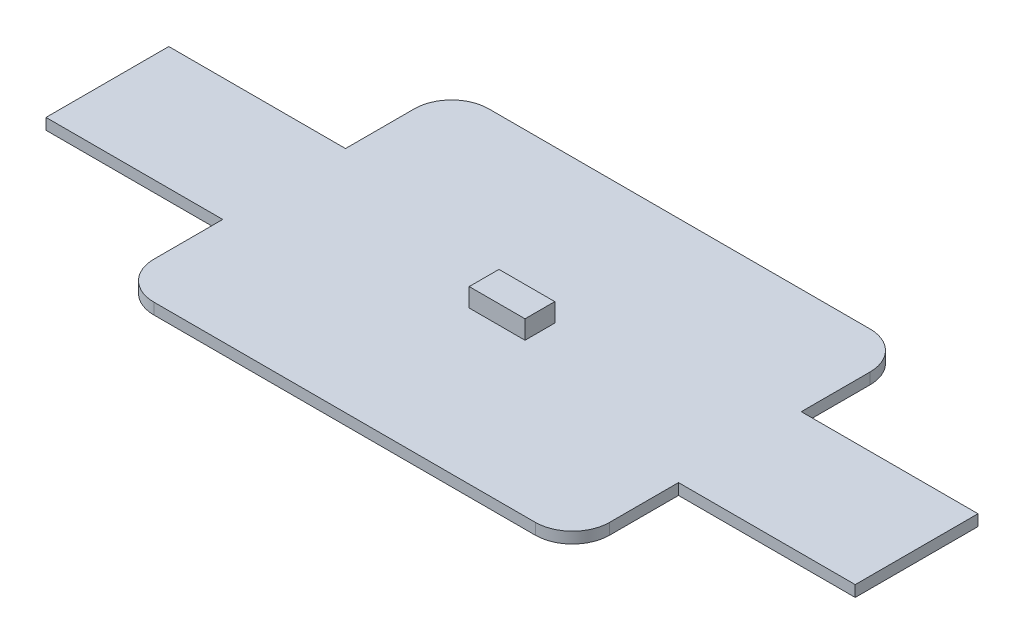
ISO-10303-21;
HEADER;
FILE_DESCRIPTION(('STEP AP214'),'2;1');
FILE_NAME('part.step','',(''),(''),'','','');
FILE_SCHEMA(('AUTOMOTIVE_DESIGN { 1 0 10303 214 1 1 1 1 }'));
ENDSEC;
DATA;
#1=APPLICATION_CONTEXT('core data for automotive mechanical design processes');
#2=APPLICATION_PROTOCOL_DEFINITION('international standard','automotive_design',2000,#1);
#3=PRODUCT_CONTEXT('',#1,'mechanical');
#4=PRODUCT('Part','Part','',(#3));
#5=PRODUCT_RELATED_PRODUCT_CATEGORY('part','',(#4));
#6=PRODUCT_DEFINITION_FORMATION('','',#4);
#7=PRODUCT_DEFINITION_CONTEXT('part definition',#1,'design');
#8=PRODUCT_DEFINITION('design','',#6,#7);
#9=PRODUCT_DEFINITION_SHAPE('','',#8);
#10=(LENGTH_UNIT() NAMED_UNIT(*) SI_UNIT(.MILLI.,.METRE.));
#11=(NAMED_UNIT(*) PLANE_ANGLE_UNIT() SI_UNIT($,.RADIAN.));
#12=(NAMED_UNIT(*) SI_UNIT($,.STERADIAN.) SOLID_ANGLE_UNIT());
#13=UNCERTAINTY_MEASURE_WITH_UNIT(LENGTH_MEASURE(1.E-05),#10,'distance_accuracy_value','');
#14=(GEOMETRIC_REPRESENTATION_CONTEXT(3) GLOBAL_UNCERTAINTY_ASSIGNED_CONTEXT((#13)) GLOBAL_UNIT_ASSIGNED_CONTEXT((#10,
#11,#12)) REPRESENTATION_CONTEXT('',''));
#15=CARTESIAN_POINT('',(0.,0.,0.));
#16=DIRECTION('',(0.,0.,1.));
#17=DIRECTION('',(1.,0.,0.));
#18=AXIS2_PLACEMENT_3D('',#15,#16,#17);
#19=CARTESIAN_POINT('',(10.25,6.6,7.));
#20=DIRECTION('',(0.,1.,0.));
#21=DIRECTION('',(0.,0.,1.));
#22=AXIS2_PLACEMENT_3D('',#19,#20,#21);
#23=PLANE('',#22);
#24=DIRECTION('',(0.,0.,-1.));
#25=VECTOR('',#24,1.);
#26=CARTESIAN_POINT('',(12.25,6.6,-7.00000000000001));
#27=LINE('',#26,#25);
#28=CARTESIAN_POINT('',(12.25,6.6,-3.3));
#29=VERTEX_POINT('',#28);
#30=CARTESIAN_POINT('',(12.25,6.6,-7.00000000000001));
#31=VERTEX_POINT('',#30);
#32=EDGE_CURVE('E224',#29,#31,#27,.T.);
#33=ORIENTED_EDGE('',*,*,#32,.T.);
#34=CARTESIAN_POINT('',(10.25,6.6,-7.));
#35=DIRECTION('',(0.,1.,0.));
#36=DIRECTION('',(0.,0.,1.));
#37=AXIS2_PLACEMENT_3D('',#34,#35,#36);
#38=CIRCLE('',#37,2.);
#39=CARTESIAN_POINT('',(10.25,6.6,-9.));
#40=VERTEX_POINT('',#39);
#41=EDGE_CURVE('E121',#31,#40,#38,.T.);
#42=ORIENTED_EDGE('',*,*,#41,.T.);
#43=DIRECTION('',(-1.,0.,0.));
#44=VECTOR('',#43,1.);
#45=CARTESIAN_POINT('',(-10.25,6.6,-9.));
#46=LINE('',#45,#44);
#47=CARTESIAN_POINT('',(-10.25,6.6,-9.));
#48=VERTEX_POINT('',#47);
#49=EDGE_CURVE('E263',#40,#48,#46,.T.);
#50=ORIENTED_EDGE('',*,*,#49,.T.);
#51=CARTESIAN_POINT('',(-10.25,6.6,-7.));
#52=DIRECTION('',(0.,1.,0.));
#53=DIRECTION('',(0.,0.,1.));
#54=AXIS2_PLACEMENT_3D('',#51,#52,#53);
#55=CIRCLE('',#54,2.);
#56=CARTESIAN_POINT('',(-12.25,6.6,-7.));
#57=VERTEX_POINT('',#56);
#58=EDGE_CURVE('E280',#48,#57,#55,.T.);
#59=ORIENTED_EDGE('',*,*,#58,.T.);
#60=DIRECTION('',(0.,0.,1.));
#61=VECTOR('',#60,1.);
#62=CARTESIAN_POINT('',(-12.25,6.6,-3.3));
#63=LINE('',#62,#61);
#64=CARTESIAN_POINT('',(-12.25,6.6,-3.3));
#65=VERTEX_POINT('',#64);
#66=EDGE_CURVE('E277',#57,#65,#63,.T.);
#67=ORIENTED_EDGE('',*,*,#66,.T.);
#68=DIRECTION('',(-1.,0.,0.));
#69=VECTOR('',#68,1.);
#70=CARTESIAN_POINT('',(-14.25,6.6,-3.3));
#71=LINE('',#70,#69);
#72=CARTESIAN_POINT('',(-21.75,6.6,-3.3));
#73=VERTEX_POINT('',#72);
#74=EDGE_CURVE('E279',#65,#73,#71,.T.);
#75=ORIENTED_EDGE('',*,*,#74,.T.);
#76=DIRECTION('',(0.,0.,1.));
#77=VECTOR('',#76,1.);
#78=CARTESIAN_POINT('',(-21.75,6.6,-3.3));
#79=LINE('',#78,#77);
#80=CARTESIAN_POINT('',(-21.75,6.6,3.3));
#81=VERTEX_POINT('',#80);
#82=EDGE_CURVE('E282',#73,#81,#79,.T.);
#83=ORIENTED_EDGE('',*,*,#82,.T.);
#84=DIRECTION('',(1.,0.,0.));
#85=VECTOR('',#84,1.);
#86=CARTESIAN_POINT('',(-21.75,6.6,3.3));
#87=LINE('',#86,#85);
#88=CARTESIAN_POINT('',(-12.25,6.6,3.3));
#89=VERTEX_POINT('',#88);
#90=EDGE_CURVE('E288',#81,#89,#87,.T.);
#91=ORIENTED_EDGE('',*,*,#90,.T.);
#92=DIRECTION('',(0.,0.,1.));
#93=VECTOR('',#92,1.);
#94=CARTESIAN_POINT('',(-12.25,6.6,3.3));
#95=LINE('',#94,#93);
#96=CARTESIAN_POINT('',(-12.25,6.6,7.));
#97=VERTEX_POINT('',#96);
#98=EDGE_CURVE('E290',#89,#97,#95,.T.);
#99=ORIENTED_EDGE('',*,*,#98,.T.);
#100=CARTESIAN_POINT('',(-10.25,6.6,7.));
#101=DIRECTION('',(0.,1.,0.));
#102=DIRECTION('',(0.,0.,1.));
#103=AXIS2_PLACEMENT_3D('',#100,#101,#102);
#104=CIRCLE('',#103,2.);
#105=CARTESIAN_POINT('',(-10.25,6.6,9.));
#106=VERTEX_POINT('',#105);
#107=EDGE_CURVE('E292',#97,#106,#104,.T.);
#108=ORIENTED_EDGE('',*,*,#107,.T.);
#109=DIRECTION('',(1.,0.,0.));
#110=VECTOR('',#109,1.);
#111=CARTESIAN_POINT('',(-10.25,6.6,9.));
#112=LINE('',#111,#110);
#113=CARTESIAN_POINT('',(10.25,6.6,9.));
#114=VERTEX_POINT('',#113);
#115=EDGE_CURVE('E294',#106,#114,#112,.T.);
#116=ORIENTED_EDGE('',*,*,#115,.T.);
#117=CARTESIAN_POINT('',(10.25,6.6,7.));
#118=DIRECTION('',(0.,1.,0.));
#119=DIRECTION('',(0.,0.,1.));
#120=AXIS2_PLACEMENT_3D('',#117,#118,#119);
#121=CIRCLE('',#120,2.);
#122=CARTESIAN_POINT('',(12.25,6.6,7.));
#123=VERTEX_POINT('',#122);
#124=EDGE_CURVE('E296',#114,#123,#121,.T.);
#125=ORIENTED_EDGE('',*,*,#124,.T.);
#126=DIRECTION('',(0.,0.,-1.));
#127=VECTOR('',#126,1.);
#128=CARTESIAN_POINT('',(12.25,6.6,7.));
#129=LINE('',#128,#127);
#130=CARTESIAN_POINT('',(12.25,6.6,3.3));
#131=VERTEX_POINT('',#130);
#132=EDGE_CURVE('E168',#123,#131,#129,.T.);
#133=ORIENTED_EDGE('',*,*,#132,.T.);
#134=DIRECTION('',(1.,0.,0.));
#135=VECTOR('',#134,1.);
#136=CARTESIAN_POINT('',(12.25,6.6,3.3));
#137=LINE('',#136,#135);
#138=CARTESIAN_POINT('',(21.75,6.6,3.3));
#139=VERTEX_POINT('',#138);
#140=EDGE_CURVE('E161',#131,#139,#137,.T.);
#141=ORIENTED_EDGE('',*,*,#140,.T.);
#142=DIRECTION('',(0.,0.,-1.));
#143=VECTOR('',#142,1.);
#144=CARTESIAN_POINT('',(21.75,6.6,3.3));
#145=LINE('',#144,#143);
#146=CARTESIAN_POINT('',(21.75,6.6,-3.3));
#147=VERTEX_POINT('',#146);
#148=EDGE_CURVE('E165',#139,#147,#145,.T.);
#149=ORIENTED_EDGE('',*,*,#148,.T.);
#150=DIRECTION('',(-1.,0.,0.));
#151=VECTOR('',#150,1.);
#152=CARTESIAN_POINT('',(21.75,6.6,-3.3));
#153=LINE('',#152,#151);
#154=EDGE_CURVE('E57',#147,#29,#153,.T.);
#155=ORIENTED_EDGE('',*,*,#154,.T.);
#156=EDGE_LOOP('',(#33,#42,#50,#59,#67,#75,#83,#91,#99,#108,#116,#125,#133,#141,#149,#155));
#157=FACE_BOUND('',#156,.T.);
#158=DIRECTION('',(-1.,0.,0.));
#159=VECTOR('',#158,1.);
#160=CARTESIAN_POINT('',(-1.5,6.6,-0.8));
#161=LINE('',#160,#159);
#162=CARTESIAN_POINT('',(1.5,6.6,-0.8));
#163=VERTEX_POINT('',#162);
#164=CARTESIAN_POINT('',(-1.5,6.6,-0.8));
#165=VERTEX_POINT('',#164);
#166=EDGE_CURVE('E330',#163,#165,#161,.T.);
#167=ORIENTED_EDGE('',*,*,#166,.F.);
#168=DIRECTION('',(0.,0.,-1.));
#169=VECTOR('',#168,1.);
#170=CARTESIAN_POINT('',(1.5,6.6,0.8));
#171=LINE('',#170,#169);
#172=CARTESIAN_POINT('',(1.5,6.6,0.8));
#173=VERTEX_POINT('',#172);
#174=EDGE_CURVE('E333',#173,#163,#171,.T.);
#175=ORIENTED_EDGE('',*,*,#174,.F.);
#176=DIRECTION('',(1.,0.,0.));
#177=VECTOR('',#176,1.);
#178=CARTESIAN_POINT('',(-1.5,6.6,0.8));
#179=LINE('',#178,#177);
#180=CARTESIAN_POINT('',(-1.5,6.6,0.8));
#181=VERTEX_POINT('',#180);
#182=EDGE_CURVE('E325',#181,#173,#179,.T.);
#183=ORIENTED_EDGE('',*,*,#182,.F.);
#184=DIRECTION('',(0.,0.,1.));
#185=VECTOR('',#184,1.);
#186=CARTESIAN_POINT('',(-1.5,6.6,0.8));
#187=LINE('',#186,#185);
#188=EDGE_CURVE('E328',#165,#181,#187,.T.);
#189=ORIENTED_EDGE('',*,*,#188,.F.);
#190=EDGE_LOOP('',(#167,#175,#183,#189));
#191=FACE_BOUND('',#190,.T.);
#192=ADVANCED_FACE('F33',(#157,#191),#23,.T.);
#193=CARTESIAN_POINT('',(12.25,6.6,-7.00000000000001));
#194=DIRECTION('',(-1.,0.,0.));
#195=DIRECTION('',(0.,0.,1.));
#196=AXIS2_PLACEMENT_3D('',#193,#194,#195);
#197=PLANE('',#196);
#198=DIRECTION('',(0.,0.,-1.));
#199=VECTOR('',#198,1.);
#200=CARTESIAN_POINT('',(12.25,6.,-7.00000000000001));
#201=LINE('',#200,#199);
#202=CARTESIAN_POINT('',(12.25,6.,-3.3));
#203=VERTEX_POINT('',#202);
#204=CARTESIAN_POINT('',(12.25,6.,-7.00000000000001));
#205=VERTEX_POINT('',#204);
#206=EDGE_CURVE('E189',#203,#205,#201,.T.);
#207=ORIENTED_EDGE('',*,*,#206,.T.);
#208=DIRECTION('',(0.,-1.,0.));
#209=VECTOR('',#208,1.);
#210=CARTESIAN_POINT('',(12.25,6.6,-7.00000000000001));
#211=LINE('',#210,#209);
#212=EDGE_CURVE('E11',#31,#205,#211,.T.);
#213=ORIENTED_EDGE('',*,*,#212,.F.);
#214=ORIENTED_EDGE('',*,*,#32,.F.);
#215=DIRECTION('',(0.,-1.,0.));
#216=VECTOR('',#215,1.);
#217=CARTESIAN_POINT('',(12.25,6.6,-3.3));
#218=LINE('',#217,#216);
#219=EDGE_CURVE('E185',#29,#203,#218,.T.);
#220=ORIENTED_EDGE('',*,*,#219,.T.);
#221=EDGE_LOOP('',(#207,#213,#214,#220));
#222=FACE_BOUND('',#221,.T.);
#223=ADVANCED_FACE('F35',(#222),#197,.F.);
#224=CARTESIAN_POINT('',(10.25,6.6,-7.));
#225=DIRECTION('',(0.,-1.,0.));
#226=DIRECTION('',(0.,0.,-1.));
#227=AXIS2_PLACEMENT_3D('',#224,#225,#226);
#228=CYLINDRICAL_SURFACE('',#227,2.);
#229=CARTESIAN_POINT('',(10.25,6.,-7.));
#230=DIRECTION('',(0.,1.,0.));
#231=DIRECTION('',(0.,0.,1.));
#232=AXIS2_PLACEMENT_3D('',#229,#230,#231);
#233=CIRCLE('',#232,2.);
#234=CARTESIAN_POINT('',(10.25,6.,-9.));
#235=VERTEX_POINT('',#234);
#236=EDGE_CURVE('E192',#205,#235,#233,.T.);
#237=ORIENTED_EDGE('',*,*,#236,.T.);
#238=DIRECTION('',(0.,-1.,0.));
#239=VECTOR('',#238,1.);
#240=CARTESIAN_POINT('',(10.25,6.6,-9.));
#241=LINE('',#240,#239);
#242=EDGE_CURVE('E41',#40,#235,#241,.T.);
#243=ORIENTED_EDGE('',*,*,#242,.F.);
#244=ORIENTED_EDGE('',*,*,#41,.F.);
#245=ORIENTED_EDGE('',*,*,#212,.T.);
#246=EDGE_LOOP('',(#237,#243,#244,#245));
#247=FACE_BOUND('',#246,.T.);
#248=ADVANCED_FACE('F379',(#247),#228,.T.);
#249=CARTESIAN_POINT('',(-10.25,6.6,-9.));
#250=DIRECTION('',(0.,0.,1.));
#251=DIRECTION('',(1.,0.,0.));
#252=AXIS2_PLACEMENT_3D('',#249,#250,#251);
#253=PLANE('',#252);
#254=DIRECTION('',(-1.,0.,0.));
#255=VECTOR('',#254,1.);
#256=CARTESIAN_POINT('',(-10.25,6.,-9.));
#257=LINE('',#256,#255);
#258=CARTESIAN_POINT('',(-10.25,6.,-9.));
#259=VERTEX_POINT('',#258);
#260=EDGE_CURVE('E195',#235,#259,#257,.T.);
#261=ORIENTED_EDGE('',*,*,#260,.T.);
#262=DIRECTION('',(0.,-1.,0.));
#263=VECTOR('',#262,1.);
#264=CARTESIAN_POINT('',(-10.25,6.6,-9.));
#265=LINE('',#264,#263);
#266=EDGE_CURVE('E255',#48,#259,#265,.T.);
#267=ORIENTED_EDGE('',*,*,#266,.F.);
#268=ORIENTED_EDGE('',*,*,#49,.F.);
#269=ORIENTED_EDGE('',*,*,#242,.T.);
#270=EDGE_LOOP('',(#261,#267,#268,#269));
#271=FACE_BOUND('',#270,.T.);
#272=ADVANCED_FACE('F261',(#271),#253,.F.);
#273=CARTESIAN_POINT('',(-10.25,6.6,-7.));
#274=DIRECTION('',(0.,-1.,0.));
#275=DIRECTION('',(0.,0.,-1.));
#276=AXIS2_PLACEMENT_3D('',#273,#274,#275);
#277=CYLINDRICAL_SURFACE('',#276,2.);
#278=CARTESIAN_POINT('',(-10.25,6.,-7.));
#279=DIRECTION('',(0.,1.,0.));
#280=DIRECTION('',(0.,0.,1.));
#281=AXIS2_PLACEMENT_3D('',#278,#279,#280);
#282=CIRCLE('',#281,2.);
#283=CARTESIAN_POINT('',(-12.25,6.,-7.));
#284=VERTEX_POINT('',#283);
#285=EDGE_CURVE('E197',#259,#284,#282,.T.);
#286=ORIENTED_EDGE('',*,*,#285,.T.);
#287=DIRECTION('',(0.,-1.,0.));
#288=VECTOR('',#287,1.);
#289=CARTESIAN_POINT('',(-12.25,6.6,-7.));
#290=LINE('',#289,#288);
#291=EDGE_CURVE('E252',#57,#284,#290,.T.);
#292=ORIENTED_EDGE('',*,*,#291,.F.);
#293=ORIENTED_EDGE('',*,*,#58,.F.);
#294=ORIENTED_EDGE('',*,*,#266,.T.);
#295=EDGE_LOOP('',(#286,#292,#293,#294));
#296=FACE_BOUND('',#295,.T.);
#297=ADVANCED_FACE('F271',(#296),#277,.T.);
#298=CARTESIAN_POINT('',(-12.25,6.6,-3.3));
#299=DIRECTION('',(1.,0.,0.));
#300=DIRECTION('',(0.,0.,-1.));
#301=AXIS2_PLACEMENT_3D('',#298,#299,#300);
#302=PLANE('',#301);
#303=DIRECTION('',(0.,0.,1.));
#304=VECTOR('',#303,1.);
#305=CARTESIAN_POINT('',(-12.25,6.,-3.3));
#306=LINE('',#305,#304);
#307=CARTESIAN_POINT('',(-12.25,6.,-3.3));
#308=VERTEX_POINT('',#307);
#309=EDGE_CURVE('E199',#284,#308,#306,.T.);
#310=ORIENTED_EDGE('',*,*,#309,.T.);
#311=DIRECTION('',(0.,-1.,0.));
#312=VECTOR('',#311,1.);
#313=CARTESIAN_POINT('',(-12.25,6.6,-3.3));
#314=LINE('',#313,#312);
#315=EDGE_CURVE('E249',#65,#308,#314,.T.);
#316=ORIENTED_EDGE('',*,*,#315,.F.);
#317=ORIENTED_EDGE('',*,*,#66,.F.);
#318=ORIENTED_EDGE('',*,*,#291,.T.);
#319=EDGE_LOOP('',(#310,#316,#317,#318));
#320=FACE_BOUND('',#319,.T.);
#321=ADVANCED_FACE('F275',(#320),#302,.F.);
#322=CARTESIAN_POINT('',(-14.25,6.6,-3.3));
#323=DIRECTION('',(0.,0.,1.));
#324=DIRECTION('',(1.,0.,0.));
#325=AXIS2_PLACEMENT_3D('',#322,#323,#324);
#326=PLANE('',#325);
#327=DIRECTION('',(-1.,0.,0.));
#328=VECTOR('',#327,1.);
#329=CARTESIAN_POINT('',(-14.25,6.,-3.3));
#330=LINE('',#329,#328);
#331=CARTESIAN_POINT('',(-21.75,6.,-3.3));
#332=VERTEX_POINT('',#331);
#333=EDGE_CURVE('E202',#308,#332,#330,.T.);
#334=ORIENTED_EDGE('',*,*,#333,.T.);
#335=DIRECTION('',(0.,-1.,0.));
#336=VECTOR('',#335,1.);
#337=CARTESIAN_POINT('',(-21.75,6.6,-3.3));
#338=LINE('',#337,#336);
#339=EDGE_CURVE('E246',#73,#332,#338,.T.);
#340=ORIENTED_EDGE('',*,*,#339,.F.);
#341=ORIENTED_EDGE('',*,*,#74,.F.);
#342=ORIENTED_EDGE('',*,*,#315,.T.);
#343=EDGE_LOOP('',(#334,#340,#341,#342));
#344=FACE_BOUND('',#343,.T.);
#345=ADVANCED_FACE('F414',(#344),#326,.F.);
#346=CARTESIAN_POINT('',(-21.75,6.6,-3.3));
#347=DIRECTION('',(1.,0.,0.));
#348=DIRECTION('',(0.,0.,-1.));
#349=AXIS2_PLACEMENT_3D('',#346,#347,#348);
#350=PLANE('',#349);
#351=DIRECTION('',(0.,0.,1.));
#352=VECTOR('',#351,1.);
#353=CARTESIAN_POINT('',(-21.75,6.,-3.3));
#354=LINE('',#353,#352);
#355=CARTESIAN_POINT('',(-21.75,6.,3.3));
#356=VERTEX_POINT('',#355);
#357=EDGE_CURVE('E204',#332,#356,#354,.T.);
#358=ORIENTED_EDGE('',*,*,#357,.T.);
#359=DIRECTION('',(0.,-1.,0.));
#360=VECTOR('',#359,1.);
#361=CARTESIAN_POINT('',(-21.75,6.6,3.3));
#362=LINE('',#361,#360);
#363=EDGE_CURVE('E243',#81,#356,#362,.T.);
#364=ORIENTED_EDGE('',*,*,#363,.F.);
#365=ORIENTED_EDGE('',*,*,#82,.F.);
#366=ORIENTED_EDGE('',*,*,#339,.T.);
#367=EDGE_LOOP('',(#358,#364,#365,#366));
#368=FACE_BOUND('',#367,.T.);
#369=ADVANCED_FACE('F410',(#368),#350,.F.);
#370=CARTESIAN_POINT('',(-14.25,6.6,3.3));
#371=DIRECTION('',(0.,0.,-1.));
#372=DIRECTION('',(-1.,0.,0.));
#373=AXIS2_PLACEMENT_3D('',#370,#371,#372);
#374=PLANE('',#373);
#375=DIRECTION('',(1.,0.,0.));
#376=VECTOR('',#375,1.);
#377=CARTESIAN_POINT('',(-14.25,6.,3.3));
#378=LINE('',#377,#376);
#379=CARTESIAN_POINT('',(-12.25,6.,3.3));
#380=VERTEX_POINT('',#379);
#381=EDGE_CURVE('E207',#356,#380,#378,.T.);
#382=ORIENTED_EDGE('',*,*,#381,.T.);
#383=DIRECTION('',(0.,-1.,0.));
#384=VECTOR('',#383,1.);
#385=CARTESIAN_POINT('',(-12.25,6.6,3.3));
#386=LINE('',#385,#384);
#387=EDGE_CURVE('E240',#89,#380,#386,.T.);
#388=ORIENTED_EDGE('',*,*,#387,.F.);
#389=ORIENTED_EDGE('',*,*,#90,.F.);
#390=ORIENTED_EDGE('',*,*,#363,.T.);
#391=EDGE_LOOP('',(#382,#388,#389,#390));
#392=FACE_BOUND('',#391,.T.);
#393=ADVANCED_FACE('F406',(#392),#374,.F.);
#394=CARTESIAN_POINT('',(-12.25,6.6,3.3));
#395=DIRECTION('',(1.,0.,0.));
#396=DIRECTION('',(0.,0.,-1.));
#397=AXIS2_PLACEMENT_3D('',#394,#395,#396);
#398=PLANE('',#397);
#399=DIRECTION('',(0.,0.,1.));
#400=VECTOR('',#399,1.);
#401=CARTESIAN_POINT('',(-12.25,6.,3.3));
#402=LINE('',#401,#400);
#403=CARTESIAN_POINT('',(-12.25,6.,7.));
#404=VERTEX_POINT('',#403);
#405=EDGE_CURVE('E209',#380,#404,#402,.T.);
#406=ORIENTED_EDGE('',*,*,#405,.T.);
#407=DIRECTION('',(0.,-1.,0.));
#408=VECTOR('',#407,1.);
#409=CARTESIAN_POINT('',(-12.25,6.6,7.));
#410=LINE('',#409,#408);
#411=EDGE_CURVE('E237',#97,#404,#410,.T.);
#412=ORIENTED_EDGE('',*,*,#411,.F.);
#413=ORIENTED_EDGE('',*,*,#98,.F.);
#414=ORIENTED_EDGE('',*,*,#387,.T.);
#415=EDGE_LOOP('',(#406,#412,#413,#414));
#416=FACE_BOUND('',#415,.T.);
#417=ADVANCED_FACE('F402',(#416),#398,.F.);
#418=CARTESIAN_POINT('',(-10.25,6.6,7.));
#419=DIRECTION('',(0.,-1.,0.));
#420=DIRECTION('',(0.,0.,-1.));
#421=AXIS2_PLACEMENT_3D('',#418,#419,#420);
#422=CYLINDRICAL_SURFACE('',#421,2.);
#423=CARTESIAN_POINT('',(-10.25,6.,7.));
#424=DIRECTION('',(0.,1.,0.));
#425=DIRECTION('',(0.,0.,1.));
#426=AXIS2_PLACEMENT_3D('',#423,#424,#425);
#427=CIRCLE('',#426,2.);
#428=CARTESIAN_POINT('',(-10.25,6.,9.));
#429=VERTEX_POINT('',#428);
#430=EDGE_CURVE('E211',#404,#429,#427,.T.);
#431=ORIENTED_EDGE('',*,*,#430,.T.);
#432=DIRECTION('',(0.,-1.,0.));
#433=VECTOR('',#432,1.);
#434=CARTESIAN_POINT('',(-10.25,6.6,9.));
#435=LINE('',#434,#433);
#436=EDGE_CURVE('E234',#106,#429,#435,.T.);
#437=ORIENTED_EDGE('',*,*,#436,.F.);
#438=ORIENTED_EDGE('',*,*,#107,.F.);
#439=ORIENTED_EDGE('',*,*,#411,.T.);
#440=EDGE_LOOP('',(#431,#437,#438,#439));
#441=FACE_BOUND('',#440,.T.);
#442=ADVANCED_FACE('F398',(#441),#422,.T.);
#443=CARTESIAN_POINT('',(-10.25,6.6,9.));
#444=DIRECTION('',(0.,0.,-1.));
#445=DIRECTION('',(-1.,0.,0.));
#446=AXIS2_PLACEMENT_3D('',#443,#444,#445);
#447=PLANE('',#446);
#448=DIRECTION('',(1.,0.,0.));
#449=VECTOR('',#448,1.);
#450=CARTESIAN_POINT('',(-10.25,6.,9.));
#451=LINE('',#450,#449);
#452=CARTESIAN_POINT('',(10.25,6.,9.));
#453=VERTEX_POINT('',#452);
#454=EDGE_CURVE('E213',#429,#453,#451,.T.);
#455=ORIENTED_EDGE('',*,*,#454,.T.);
#456=DIRECTION('',(0.,-1.,0.));
#457=VECTOR('',#456,1.);
#458=CARTESIAN_POINT('',(10.25,6.6,9.));
#459=LINE('',#458,#457);
#460=EDGE_CURVE('E231',#114,#453,#459,.T.);
#461=ORIENTED_EDGE('',*,*,#460,.F.);
#462=ORIENTED_EDGE('',*,*,#115,.F.);
#463=ORIENTED_EDGE('',*,*,#436,.T.);
#464=EDGE_LOOP('',(#455,#461,#462,#463));
#465=FACE_BOUND('',#464,.T.);
#466=ADVANCED_FACE('F395',(#465),#447,.F.);
#467=CARTESIAN_POINT('',(10.25,6.6,7.));
#468=DIRECTION('',(0.,-1.,0.));
#469=DIRECTION('',(0.,0.,-1.));
#470=AXIS2_PLACEMENT_3D('',#467,#468,#469);
#471=CYLINDRICAL_SURFACE('',#470,2.);
#472=CARTESIAN_POINT('',(10.25,6.,7.));
#473=DIRECTION('',(0.,1.,0.));
#474=DIRECTION('',(0.,0.,1.));
#475=AXIS2_PLACEMENT_3D('',#472,#473,#474);
#476=CIRCLE('',#475,2.);
#477=CARTESIAN_POINT('',(12.25,6.,7.));
#478=VERTEX_POINT('',#477);
#479=EDGE_CURVE('E215',#453,#478,#476,.T.);
#480=ORIENTED_EDGE('',*,*,#479,.T.);
#481=DIRECTION('',(0.,-1.,0.));
#482=VECTOR('',#481,1.);
#483=CARTESIAN_POINT('',(12.25,6.6,7.));
#484=LINE('',#483,#482);
#485=EDGE_CURVE('E228',#123,#478,#484,.T.);
#486=ORIENTED_EDGE('',*,*,#485,.F.);
#487=ORIENTED_EDGE('',*,*,#124,.F.);
#488=ORIENTED_EDGE('',*,*,#460,.T.);
#489=EDGE_LOOP('',(#480,#486,#487,#488));
#490=FACE_BOUND('',#489,.T.);
#491=ADVANCED_FACE('F302',(#490),#471,.T.);
#492=CARTESIAN_POINT('',(12.25,6.6,7.));
#493=DIRECTION('',(-1.,0.,0.));
#494=DIRECTION('',(0.,0.,1.));
#495=AXIS2_PLACEMENT_3D('',#492,#493,#494);
#496=PLANE('',#495);
#497=DIRECTION('',(0.,0.,-1.));
#498=VECTOR('',#497,1.);
#499=CARTESIAN_POINT('',(12.25,6.,7.));
#500=LINE('',#499,#498);
#501=CARTESIAN_POINT('',(12.25,6.,3.3));
#502=VERTEX_POINT('',#501);
#503=EDGE_CURVE('E217',#478,#502,#500,.T.);
#504=ORIENTED_EDGE('',*,*,#503,.T.);
#505=DIRECTION('',(0.,-1.,0.));
#506=VECTOR('',#505,1.);
#507=CARTESIAN_POINT('',(12.25,6.6,3.3));
#508=LINE('',#507,#506);
#509=EDGE_CURVE('E180',#131,#502,#508,.T.);
#510=ORIENTED_EDGE('',*,*,#509,.F.);
#511=ORIENTED_EDGE('',*,*,#132,.F.);
#512=ORIENTED_EDGE('',*,*,#485,.T.);
#513=EDGE_LOOP('',(#504,#510,#511,#512));
#514=FACE_BOUND('',#513,.T.);
#515=ADVANCED_FACE('F306',(#514),#496,.F.);
#516=CARTESIAN_POINT('',(14.25,6.6,3.3));
#517=DIRECTION('',(0.,0.,-1.));
#518=DIRECTION('',(-1.,0.,0.));
#519=AXIS2_PLACEMENT_3D('',#516,#517,#518);
#520=PLANE('',#519);
#521=DIRECTION('',(1.,0.,0.));
#522=VECTOR('',#521,1.);
#523=CARTESIAN_POINT('',(14.25,6.,3.3));
#524=LINE('',#523,#522);
#525=CARTESIAN_POINT('',(21.75,6.,3.3));
#526=VERTEX_POINT('',#525);
#527=EDGE_CURVE('E176',#502,#526,#524,.T.);
#528=ORIENTED_EDGE('',*,*,#527,.T.);
#529=DIRECTION('',(0.,-1.,0.));
#530=VECTOR('',#529,1.);
#531=CARTESIAN_POINT('',(21.75,6.6,3.3));
#532=LINE('',#531,#530);
#533=EDGE_CURVE('E174',#139,#526,#532,.T.);
#534=ORIENTED_EDGE('',*,*,#533,.F.);
#535=ORIENTED_EDGE('',*,*,#140,.F.);
#536=ORIENTED_EDGE('',*,*,#509,.T.);
#537=EDGE_LOOP('',(#528,#534,#535,#536));
#538=FACE_BOUND('',#537,.T.);
#539=ADVANCED_FACE('F175',(#538),#520,.F.);
#540=CARTESIAN_POINT('',(21.75,6.6,3.3));
#541=DIRECTION('',(-1.,0.,0.));
#542=DIRECTION('',(0.,0.,1.));
#543=AXIS2_PLACEMENT_3D('',#540,#541,#542);
#544=PLANE('',#543);
#545=DIRECTION('',(0.,0.,-1.));
#546=VECTOR('',#545,1.);
#547=CARTESIAN_POINT('',(21.75,6.,3.3));
#548=LINE('',#547,#546);
#549=CARTESIAN_POINT('',(21.75,6.,-3.3));
#550=VERTEX_POINT('',#549);
#551=EDGE_CURVE('E221',#526,#550,#548,.T.);
#552=ORIENTED_EDGE('',*,*,#551,.T.);
#553=DIRECTION('',(0.,-1.,0.));
#554=VECTOR('',#553,1.);
#555=CARTESIAN_POINT('',(21.75,6.6,-3.3));
#556=LINE('',#555,#554);
#557=EDGE_CURVE('E181',#147,#550,#556,.T.);
#558=ORIENTED_EDGE('',*,*,#557,.F.);
#559=ORIENTED_EDGE('',*,*,#148,.F.);
#560=ORIENTED_EDGE('',*,*,#533,.T.);
#561=EDGE_LOOP('',(#552,#558,#559,#560));
#562=FACE_BOUND('',#561,.T.);
#563=ADVANCED_FACE('F183',(#562),#544,.F.);
#564=CARTESIAN_POINT('',(12.25,6.6,-3.3));
#565=DIRECTION('',(0.,0.,1.));
#566=DIRECTION('',(1.,0.,0.));
#567=AXIS2_PLACEMENT_3D('',#564,#565,#566);
#568=PLANE('',#567);
#569=DIRECTION('',(-1.,0.,0.));
#570=VECTOR('',#569,1.);
#571=CARTESIAN_POINT('',(12.25,6.,-3.3));
#572=LINE('',#571,#570);
#573=EDGE_CURVE('E113',#550,#203,#572,.T.);
#574=ORIENTED_EDGE('',*,*,#573,.T.);
#575=ORIENTED_EDGE('',*,*,#219,.F.);
#576=ORIENTED_EDGE('',*,*,#154,.F.);
#577=ORIENTED_EDGE('',*,*,#557,.T.);
#578=EDGE_LOOP('',(#574,#575,#576,#577));
#579=FACE_BOUND('',#578,.T.);
#580=ADVANCED_FACE('F308',(#579),#568,.F.);
#581=CARTESIAN_POINT('',(10.25,6.,7.));
#582=DIRECTION('',(0.,1.,0.));
#583=DIRECTION('',(0.,0.,1.));
#584=AXIS2_PLACEMENT_3D('',#581,#582,#583);
#585=PLANE('',#584);
#586=ORIENTED_EDGE('',*,*,#206,.F.);
#587=ORIENTED_EDGE('',*,*,#573,.F.);
#588=ORIENTED_EDGE('',*,*,#551,.F.);
#589=ORIENTED_EDGE('',*,*,#527,.F.);
#590=ORIENTED_EDGE('',*,*,#503,.F.);
#591=ORIENTED_EDGE('',*,*,#479,.F.);
#592=ORIENTED_EDGE('',*,*,#454,.F.);
#593=ORIENTED_EDGE('',*,*,#430,.F.);
#594=ORIENTED_EDGE('',*,*,#405,.F.);
#595=ORIENTED_EDGE('',*,*,#381,.F.);
#596=ORIENTED_EDGE('',*,*,#357,.F.);
#597=ORIENTED_EDGE('',*,*,#333,.F.);
#598=ORIENTED_EDGE('',*,*,#309,.F.);
#599=ORIENTED_EDGE('',*,*,#285,.F.);
#600=ORIENTED_EDGE('',*,*,#260,.F.);
#601=ORIENTED_EDGE('',*,*,#236,.F.);
#602=EDGE_LOOP('',(#586,#587,#588,#589,#590,#591,#592,#593,#594,#595,#596,#597,#598,#599,#600,#601));
#603=FACE_BOUND('',#602,.T.);
#604=ADVANCED_FACE('F267',(#603),#585,.F.);
#605=CARTESIAN_POINT('',(1.5,7.6,0.8));
#606=DIRECTION('',(-1.,0.,0.));
#607=DIRECTION('',(0.,0.,1.));
#608=AXIS2_PLACEMENT_3D('',#605,#606,#607);
#609=PLANE('',#608);
#610=ORIENTED_EDGE('',*,*,#174,.T.);
#611=DIRECTION('',(0.,-1.,0.));
#612=VECTOR('',#611,1.);
#613=CARTESIAN_POINT('',(1.5,7.6,-0.8));
#614=LINE('',#613,#612);
#615=CARTESIAN_POINT('',(1.5,7.6,-0.8));
#616=VERTEX_POINT('',#615);
#617=EDGE_CURVE('E193',#616,#163,#614,.T.);
#618=ORIENTED_EDGE('',*,*,#617,.F.);
#619=DIRECTION('',(0.,0.,-1.));
#620=VECTOR('',#619,1.);
#621=CARTESIAN_POINT('',(1.5,7.6,0.8));
#622=LINE('',#621,#620);
#623=CARTESIAN_POINT('',(1.5,7.6,0.8));
#624=VERTEX_POINT('',#623);
#625=EDGE_CURVE('E327',#624,#616,#622,.T.);
#626=ORIENTED_EDGE('',*,*,#625,.F.);
#627=DIRECTION('',(0.,-1.,0.));
#628=VECTOR('',#627,1.);
#629=CARTESIAN_POINT('',(1.5,7.6,0.8));
#630=LINE('',#629,#628);
#631=EDGE_CURVE('E321',#624,#173,#630,.T.);
#632=ORIENTED_EDGE('',*,*,#631,.T.);
#633=EDGE_LOOP('',(#610,#618,#626,#632));
#634=FACE_BOUND('',#633,.T.);
#635=ADVANCED_FACE('F356',(#634),#609,.F.);
#636=CARTESIAN_POINT('',(-1.5,7.6,-0.8));
#637=DIRECTION('',(0.,0.,1.));
#638=DIRECTION('',(1.,0.,0.));
#639=AXIS2_PLACEMENT_3D('',#636,#637,#638);
#640=PLANE('',#639);
#641=ORIENTED_EDGE('',*,*,#166,.T.);
#642=DIRECTION('',(0.,-1.,0.));
#643=VECTOR('',#642,1.);
#644=CARTESIAN_POINT('',(-1.5,7.6,-0.8));
#645=LINE('',#644,#643);
#646=CARTESIAN_POINT('',(-1.5,7.6,-0.8));
#647=VERTEX_POINT('',#646);
#648=EDGE_CURVE('E317',#647,#165,#645,.T.);
#649=ORIENTED_EDGE('',*,*,#648,.F.);
#650=DIRECTION('',(-1.,0.,0.));
#651=VECTOR('',#650,1.);
#652=CARTESIAN_POINT('',(-1.5,7.6,-0.8));
#653=LINE('',#652,#651);
#654=EDGE_CURVE('E341',#616,#647,#653,.T.);
#655=ORIENTED_EDGE('',*,*,#654,.F.);
#656=ORIENTED_EDGE('',*,*,#617,.T.);
#657=EDGE_LOOP('',(#641,#649,#655,#656));
#658=FACE_BOUND('',#657,.T.);
#659=ADVANCED_FACE('F361',(#658),#640,.F.);
#660=CARTESIAN_POINT('',(-1.5,7.6,0.8));
#661=DIRECTION('',(1.,0.,0.));
#662=DIRECTION('',(0.,0.,-1.));
#663=AXIS2_PLACEMENT_3D('',#660,#661,#662);
#664=PLANE('',#663);
#665=ORIENTED_EDGE('',*,*,#188,.T.);
#666=DIRECTION('',(0.,-1.,0.));
#667=VECTOR('',#666,1.);
#668=CARTESIAN_POINT('',(-1.5,7.6,0.8));
#669=LINE('',#668,#667);
#670=CARTESIAN_POINT('',(-1.5,7.6,0.8));
#671=VERTEX_POINT('',#670);
#672=EDGE_CURVE('E48',#671,#181,#669,.T.);
#673=ORIENTED_EDGE('',*,*,#672,.F.);
#674=DIRECTION('',(0.,0.,1.));
#675=VECTOR('',#674,1.);
#676=CARTESIAN_POINT('',(-1.5,7.6,0.8));
#677=LINE('',#676,#675);
#678=EDGE_CURVE('E338',#647,#671,#677,.T.);
#679=ORIENTED_EDGE('',*,*,#678,.F.);
#680=ORIENTED_EDGE('',*,*,#648,.T.);
#681=EDGE_LOOP('',(#665,#673,#679,#680));
#682=FACE_BOUND('',#681,.T.);
#683=ADVANCED_FACE('F370',(#682),#664,.F.);
#684=CARTESIAN_POINT('',(-1.5,7.6,0.8));
#685=DIRECTION('',(0.,0.,-1.));
#686=DIRECTION('',(-1.,0.,0.));
#687=AXIS2_PLACEMENT_3D('',#684,#685,#686);
#688=PLANE('',#687);
#689=ORIENTED_EDGE('',*,*,#182,.T.);
#690=ORIENTED_EDGE('',*,*,#631,.F.);
#691=DIRECTION('',(1.,0.,0.));
#692=VECTOR('',#691,1.);
#693=CARTESIAN_POINT('',(-1.5,7.6,0.8));
#694=LINE('',#693,#692);
#695=EDGE_CURVE('E324',#671,#624,#694,.T.);
#696=ORIENTED_EDGE('',*,*,#695,.F.);
#697=ORIENTED_EDGE('',*,*,#672,.T.);
#698=EDGE_LOOP('',(#689,#690,#696,#697));
#699=FACE_BOUND('',#698,.T.);
#700=ADVANCED_FACE('F373',(#699),#688,.F.);
#701=CARTESIAN_POINT('',(0.,7.6,0.));
#702=DIRECTION('',(0.,-1.,0.));
#703=DIRECTION('',(0.,0.,-1.));
#704=AXIS2_PLACEMENT_3D('',#701,#702,#703);
#705=PLANE('',#704);
#706=ORIENTED_EDGE('',*,*,#625,.T.);
#707=ORIENTED_EDGE('',*,*,#654,.T.);
#708=ORIENTED_EDGE('',*,*,#678,.T.);
#709=ORIENTED_EDGE('',*,*,#695,.T.);
#710=EDGE_LOOP('',(#706,#707,#708,#709));
#711=FACE_BOUND('',#710,.T.);
#712=ADVANCED_FACE('F349',(#711),#705,.F.);
#713=CLOSED_SHELL('',(#192,#223,#248,#272,#297,#321,#345,#369,#393,#417,#442,#466,#491,#515,
#539,#563,#580,#604,#635,#659,#683,#700,#712));
#714=MANIFOLD_SOLID_BREP('B2',#713);
#715=ADVANCED_BREP_SHAPE_REPRESENTATION('',(#18,#714),#14);
#716=SHAPE_DEFINITION_REPRESENTATION(#9,#715);
ENDSEC;
END-ISO-10303-21;
